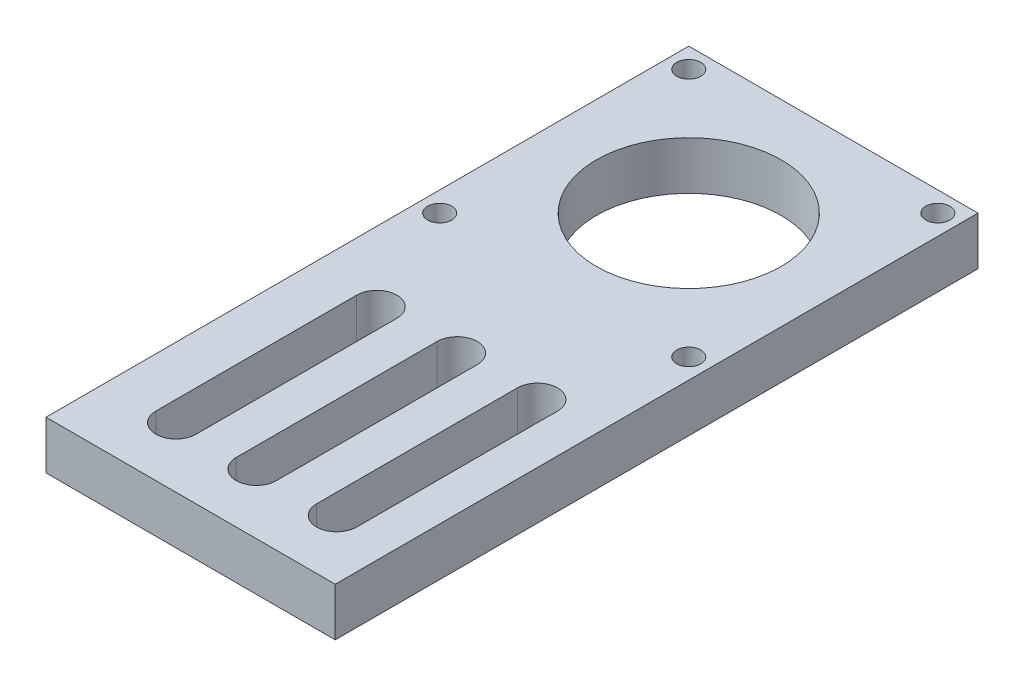
ISO-10303-21;
HEADER;
FILE_DESCRIPTION(('STEP AP214'),'2;1');
FILE_NAME('part.step','',(''),(''),'','','');
FILE_SCHEMA(('AUTOMOTIVE_DESIGN { 1 0 10303 214 1 1 1 1 }'));
ENDSEC;
DATA;
#1=APPLICATION_CONTEXT('core data for automotive mechanical design processes');
#2=APPLICATION_PROTOCOL_DEFINITION('international standard','automotive_design',2000,#1);
#3=PRODUCT_CONTEXT('',#1,'mechanical');
#4=PRODUCT('Part','Part','',(#3));
#5=PRODUCT_RELATED_PRODUCT_CATEGORY('part','',(#4));
#6=PRODUCT_DEFINITION_FORMATION('','',#4);
#7=PRODUCT_DEFINITION_CONTEXT('part definition',#1,'design');
#8=PRODUCT_DEFINITION('design','',#6,#7);
#9=PRODUCT_DEFINITION_SHAPE('','',#8);
#10=(LENGTH_UNIT() NAMED_UNIT(*) SI_UNIT(.MILLI.,.METRE.));
#11=(NAMED_UNIT(*) PLANE_ANGLE_UNIT() SI_UNIT($,.RADIAN.));
#12=(NAMED_UNIT(*) SI_UNIT($,.STERADIAN.) SOLID_ANGLE_UNIT());
#13=UNCERTAINTY_MEASURE_WITH_UNIT(LENGTH_MEASURE(1.E-05),#10,'distance_accuracy_value','');
#14=(GEOMETRIC_REPRESENTATION_CONTEXT(3) GLOBAL_UNCERTAINTY_ASSIGNED_CONTEXT((#13)) GLOBAL_UNIT_ASSIGNED_CONTEXT((#10,
#11,#12)) REPRESENTATION_CONTEXT('',''));
#15=CARTESIAN_POINT('',(0.,0.,0.));
#16=DIRECTION('',(0.,0.,1.));
#17=DIRECTION('',(1.,0.,0.));
#18=AXIS2_PLACEMENT_3D('',#15,#16,#17);
#19=CARTESIAN_POINT('',(0.,6.,0.));
#20=DIRECTION('',(0.,-1.,0.));
#21=DIRECTION('',(0.,0.,-1.));
#22=AXIS2_PLACEMENT_3D('',#19,#20,#21);
#23=PLANE('',#22);
#24=CARTESIAN_POINT('',(10.6727513266154,6.,7.5));
#25=DIRECTION('',(0.,1.,0.));
#26=DIRECTION('',(0.,0.,-1.));
#27=AXIS2_PLACEMENT_3D('',#24,#25,#26);
#28=CIRCLE('',#27,2.5);
#29=CARTESIAN_POINT('',(13.1727513266154,6.,7.5));
#30=VERTEX_POINT('',#29);
#31=CARTESIAN_POINT('',(8.17275132661536,6.,7.5));
#32=VERTEX_POINT('',#31);
#33=EDGE_CURVE('E181',#30,#32,#28,.T.);
#34=ORIENTED_EDGE('',*,*,#33,.F.);
#35=DIRECTION('',(0.,0.,-1.));
#36=VECTOR('',#35,1.);
#37=CARTESIAN_POINT('',(13.1727513266154,6.,32.5));
#38=LINE('',#37,#36);
#39=CARTESIAN_POINT('',(13.1727513266154,6.,32.5));
#40=VERTEX_POINT('',#39);
#41=EDGE_CURVE('E189',#40,#30,#38,.T.);
#42=ORIENTED_EDGE('',*,*,#41,.F.);
#43=CARTESIAN_POINT('',(10.6727513266154,6.,32.5));
#44=DIRECTION('',(0.,1.,0.));
#45=DIRECTION('',(0.,0.,1.));
#46=AXIS2_PLACEMENT_3D('',#43,#44,#45);
#47=CIRCLE('',#46,2.5);
#48=CARTESIAN_POINT('',(8.17275132661536,6.,32.5));
#49=VERTEX_POINT('',#48);
#50=EDGE_CURVE('E186',#49,#40,#47,.T.);
#51=ORIENTED_EDGE('',*,*,#50,.F.);
#52=DIRECTION('',(0.,0.,1.));
#53=VECTOR('',#52,1.);
#54=CARTESIAN_POINT('',(8.17275132661536,6.,32.5));
#55=LINE('',#54,#53);
#56=EDGE_CURVE('E183',#32,#49,#55,.T.);
#57=ORIENTED_EDGE('',*,*,#56,.F.);
#58=EDGE_LOOP('',(#34,#42,#51,#57));
#59=FACE_BOUND('',#58,.T.);
#60=CARTESIAN_POINT('',(-15.5,6.,-6.5));
#61=DIRECTION('',(0.,1.,0.));
#62=DIRECTION('',(0.,0.,1.));
#63=AXIS2_PLACEMENT_3D('',#60,#61,#62);
#64=CIRCLE('',#63,1.5);
#65=CARTESIAN_POINT('',(-15.5,6.,-5.));
#66=VERTEX_POINT('',#65);
#67=EDGE_CURVE('E243',#66,#66,#64,.T.);
#68=ORIENTED_EDGE('',*,*,#67,.F.);
#69=EDGE_LOOP('',(#68));
#70=FACE_BOUND('',#69,.T.);
#71=CARTESIAN_POINT('',(15.5,6.,-6.5));
#72=DIRECTION('',(0.,1.,0.));
#73=DIRECTION('',(0.,0.,1.));
#74=AXIS2_PLACEMENT_3D('',#71,#72,#73);
#75=CIRCLE('',#74,1.5);
#76=CARTESIAN_POINT('',(15.5,6.,-5.00000000000001));
#77=VERTEX_POINT('',#76);
#78=EDGE_CURVE('E249',#77,#77,#75,.T.);
#79=ORIENTED_EDGE('',*,*,#78,.F.);
#80=EDGE_LOOP('',(#79));
#81=FACE_BOUND('',#80,.T.);
#82=CARTESIAN_POINT('',(15.5,6.,-37.5));
#83=DIRECTION('',(0.,1.,0.));
#84=DIRECTION('',(0.,0.,1.));
#85=AXIS2_PLACEMENT_3D('',#82,#83,#84);
#86=CIRCLE('',#85,1.5);
#87=CARTESIAN_POINT('',(15.5,6.,-36.));
#88=VERTEX_POINT('',#87);
#89=EDGE_CURVE('E255',#88,#88,#86,.T.);
#90=ORIENTED_EDGE('',*,*,#89,.F.);
#91=EDGE_LOOP('',(#90));
#92=FACE_BOUND('',#91,.T.);
#93=CARTESIAN_POINT('',(-15.5,6.,-37.5));
#94=DIRECTION('',(0.,1.,0.));
#95=DIRECTION('',(0.,0.,1.));
#96=AXIS2_PLACEMENT_3D('',#93,#94,#95);
#97=CIRCLE('',#96,1.5);
#98=CARTESIAN_POINT('',(-15.5,6.,-36.));
#99=VERTEX_POINT('',#98);
#100=EDGE_CURVE('E261',#99,#99,#97,.T.);
#101=ORIENTED_EDGE('',*,*,#100,.F.);
#102=EDGE_LOOP('',(#101));
#103=FACE_BOUND('',#102,.T.);
#104=CARTESIAN_POINT('',(0.,6.,-22.));
#105=DIRECTION('',(0.,1.,0.));
#106=DIRECTION('',(0.,0.,1.));
#107=AXIS2_PLACEMENT_3D('',#104,#105,#106);
#108=CIRCLE('',#107,11.5);
#109=CARTESIAN_POINT('',(0.,6.,-10.5));
#110=VERTEX_POINT('',#109);
#111=EDGE_CURVE('E267',#110,#110,#108,.T.);
#112=ORIENTED_EDGE('',*,*,#111,.F.);
#113=EDGE_LOOP('',(#112));
#114=FACE_BOUND('',#113,.T.);
#115=DIRECTION('',(0.,0.,-1.));
#116=VECTOR('',#115,1.);
#117=CARTESIAN_POINT('',(18.,6.,40.));
#118=LINE('',#117,#116);
#119=CARTESIAN_POINT('',(18.,6.,40.));
#120=VERTEX_POINT('',#119);
#121=CARTESIAN_POINT('',(18.,6.,-40.));
#122=VERTEX_POINT('',#121);
#123=EDGE_CURVE('E273',#120,#122,#118,.T.);
#124=ORIENTED_EDGE('',*,*,#123,.T.);
#125=DIRECTION('',(-1.,0.,0.));
#126=VECTOR('',#125,1.);
#127=CARTESIAN_POINT('',(-18.,6.,-40.));
#128=LINE('',#127,#126);
#129=CARTESIAN_POINT('',(-18.,6.,-40.));
#130=VERTEX_POINT('',#129);
#131=EDGE_CURVE('E276',#122,#130,#128,.T.);
#132=ORIENTED_EDGE('',*,*,#131,.T.);
#133=DIRECTION('',(0.,0.,1.));
#134=VECTOR('',#133,1.);
#135=CARTESIAN_POINT('',(-18.,6.,40.));
#136=LINE('',#135,#134);
#137=CARTESIAN_POINT('',(-18.,6.,40.));
#138=VERTEX_POINT('',#137);
#139=EDGE_CURVE('E279',#130,#138,#136,.T.);
#140=ORIENTED_EDGE('',*,*,#139,.T.);
#141=DIRECTION('',(1.,0.,0.));
#142=VECTOR('',#141,1.);
#143=CARTESIAN_POINT('',(-18.,6.,40.));
#144=LINE('',#143,#142);
#145=EDGE_CURVE('E281',#138,#120,#144,.T.);
#146=ORIENTED_EDGE('',*,*,#145,.T.);
#147=EDGE_LOOP('',(#124,#132,#140,#146));
#148=FACE_BOUND('',#147,.T.);
#149=CARTESIAN_POINT('',(0.672751326615361,6.,7.5));
#150=DIRECTION('',(0.,1.,0.));
#151=DIRECTION('',(0.,0.,-1.));
#152=AXIS2_PLACEMENT_3D('',#149,#150,#151);
#153=CIRCLE('',#152,2.5);
#154=CARTESIAN_POINT('',(3.17275132661536,6.,7.5));
#155=VERTEX_POINT('',#154);
#156=CARTESIAN_POINT('',(-1.82724867338464,6.,7.5));
#157=VERTEX_POINT('',#156);
#158=EDGE_CURVE('E212',#155,#157,#153,.T.);
#159=ORIENTED_EDGE('',*,*,#158,.F.);
#160=DIRECTION('',(0.,0.,-1.));
#161=VECTOR('',#160,1.);
#162=CARTESIAN_POINT('',(3.17275132661536,6.,32.5));
#163=LINE('',#162,#161);
#164=CARTESIAN_POINT('',(3.17275132661536,6.,32.5));
#165=VERTEX_POINT('',#164);
#166=EDGE_CURVE('E220',#165,#155,#163,.T.);
#167=ORIENTED_EDGE('',*,*,#166,.F.);
#168=CARTESIAN_POINT('',(0.672751326615361,6.,32.5));
#169=DIRECTION('',(0.,1.,0.));
#170=DIRECTION('',(0.,0.,1.));
#171=AXIS2_PLACEMENT_3D('',#168,#169,#170);
#172=CIRCLE('',#171,2.5);
#173=CARTESIAN_POINT('',(-1.82724867338464,6.,32.5));
#174=VERTEX_POINT('',#173);
#175=EDGE_CURVE('E217',#174,#165,#172,.T.);
#176=ORIENTED_EDGE('',*,*,#175,.F.);
#177=DIRECTION('',(0.,0.,1.));
#178=VECTOR('',#177,1.);
#179=CARTESIAN_POINT('',(-1.82724867338464,6.,32.5));
#180=LINE('',#179,#178);
#181=EDGE_CURVE('E214',#157,#174,#180,.T.);
#182=ORIENTED_EDGE('',*,*,#181,.F.);
#183=EDGE_LOOP('',(#159,#167,#176,#182));
#184=FACE_BOUND('',#183,.T.);
#185=CARTESIAN_POINT('',(-9.32724867338463,6.,7.5));
#186=DIRECTION('',(0.,1.,0.));
#187=DIRECTION('',(0.,0.,-1.));
#188=AXIS2_PLACEMENT_3D('',#185,#186,#187);
#189=CIRCLE('',#188,2.5);
#190=CARTESIAN_POINT('',(-6.82724867338463,6.,7.5));
#191=VERTEX_POINT('',#190);
#192=CARTESIAN_POINT('',(-11.8272486733846,6.,7.5));
#193=VERTEX_POINT('',#192);
#194=EDGE_CURVE('E145',#191,#193,#189,.T.);
#195=ORIENTED_EDGE('',*,*,#194,.F.);
#196=DIRECTION('',(0.,0.,-1.));
#197=VECTOR('',#196,1.);
#198=CARTESIAN_POINT('',(-6.82724867338463,6.,32.5));
#199=LINE('',#198,#197);
#200=CARTESIAN_POINT('',(-6.82724867338463,6.,32.5));
#201=VERTEX_POINT('',#200);
#202=EDGE_CURVE('E167',#201,#191,#199,.T.);
#203=ORIENTED_EDGE('',*,*,#202,.F.);
#204=CARTESIAN_POINT('',(-9.32724867338463,6.,32.5));
#205=DIRECTION('',(0.,1.,0.));
#206=DIRECTION('',(0.,0.,-1.));
#207=AXIS2_PLACEMENT_3D('',#204,#205,#206);
#208=CIRCLE('',#207,2.5);
#209=CARTESIAN_POINT('',(-11.8272486733846,6.,32.5));
#210=VERTEX_POINT('',#209);
#211=EDGE_CURVE('E165',#210,#201,#208,.T.);
#212=ORIENTED_EDGE('',*,*,#211,.F.);
#213=DIRECTION('',(0.,0.,1.));
#214=VECTOR('',#213,1.);
#215=CARTESIAN_POINT('',(-11.8272486733846,6.,32.5));
#216=LINE('',#215,#214);
#217=EDGE_CURVE('E153',#193,#210,#216,.T.);
#218=ORIENTED_EDGE('',*,*,#217,.F.);
#219=EDGE_LOOP('',(#195,#203,#212,#218));
#220=FACE_BOUND('',#219,.T.);
#221=ADVANCED_FACE('F32',(#59,#70,#81,#92,#103,#114,#148,#184,#220),#23,.F.);
#222=CARTESIAN_POINT('',(0.,0.,0.));
#223=DIRECTION('',(0.,-1.,0.));
#224=DIRECTION('',(0.,0.,-1.));
#225=AXIS2_PLACEMENT_3D('',#222,#223,#224);
#226=PLANE('',#225);
#227=CARTESIAN_POINT('',(15.5,0.,-6.5));
#228=DIRECTION('',(0.,1.,0.));
#229=DIRECTION('',(0.,0.,1.));
#230=AXIS2_PLACEMENT_3D('',#227,#228,#229);
#231=CIRCLE('',#230,1.5);
#232=CARTESIAN_POINT('',(15.5,0.,-5.00000000000001));
#233=VERTEX_POINT('',#232);
#234=EDGE_CURVE('E246',#233,#233,#231,.T.);
#235=ORIENTED_EDGE('',*,*,#234,.T.);
#236=EDGE_LOOP('',(#235));
#237=FACE_BOUND('',#236,.T.);
#238=CARTESIAN_POINT('',(-15.5,0.,-37.5));
#239=DIRECTION('',(0.,1.,0.));
#240=DIRECTION('',(0.,0.,1.));
#241=AXIS2_PLACEMENT_3D('',#238,#239,#240);
#242=CIRCLE('',#241,1.5);
#243=CARTESIAN_POINT('',(-15.5,0.,-36.));
#244=VERTEX_POINT('',#243);
#245=EDGE_CURVE('E258',#244,#244,#242,.T.);
#246=ORIENTED_EDGE('',*,*,#245,.T.);
#247=EDGE_LOOP('',(#246));
#248=FACE_BOUND('',#247,.T.);
#249=DIRECTION('',(0.,0.,-1.));
#250=VECTOR('',#249,1.);
#251=CARTESIAN_POINT('',(18.,0.,40.));
#252=LINE('',#251,#250);
#253=CARTESIAN_POINT('',(18.,0.,40.));
#254=VERTEX_POINT('',#253);
#255=CARTESIAN_POINT('',(18.,0.,-40.));
#256=VERTEX_POINT('',#255);
#257=EDGE_CURVE('E270',#254,#256,#252,.T.);
#258=ORIENTED_EDGE('',*,*,#257,.F.);
#259=DIRECTION('',(1.,0.,0.));
#260=VECTOR('',#259,1.);
#261=CARTESIAN_POINT('',(-18.,0.,40.));
#262=LINE('',#261,#260);
#263=CARTESIAN_POINT('',(-18.,0.,40.));
#264=VERTEX_POINT('',#263);
#265=EDGE_CURVE('E277',#264,#254,#262,.T.);
#266=ORIENTED_EDGE('',*,*,#265,.F.);
#267=DIRECTION('',(0.,0.,1.));
#268=VECTOR('',#267,1.);
#269=CARTESIAN_POINT('',(-18.,0.,40.));
#270=LINE('',#269,#268);
#271=CARTESIAN_POINT('',(-18.,0.,-40.));
#272=VERTEX_POINT('',#271);
#273=EDGE_CURVE('E288',#272,#264,#270,.T.);
#274=ORIENTED_EDGE('',*,*,#273,.F.);
#275=DIRECTION('',(-1.,0.,0.));
#276=VECTOR('',#275,1.);
#277=CARTESIAN_POINT('',(-18.,0.,-40.));
#278=LINE('',#277,#276);
#279=EDGE_CURVE('E286',#256,#272,#278,.T.);
#280=ORIENTED_EDGE('',*,*,#279,.F.);
#281=EDGE_LOOP('',(#258,#266,#274,#280));
#282=FACE_BOUND('',#281,.T.);
#283=CARTESIAN_POINT('',(0.,0.,-22.));
#284=DIRECTION('',(0.,1.,0.));
#285=DIRECTION('',(0.,0.,1.));
#286=AXIS2_PLACEMENT_3D('',#283,#284,#285);
#287=CIRCLE('',#286,11.5);
#288=CARTESIAN_POINT('',(0.,0.,-10.5));
#289=VERTEX_POINT('',#288);
#290=EDGE_CURVE('E264',#289,#289,#287,.T.);
#291=ORIENTED_EDGE('',*,*,#290,.T.);
#292=EDGE_LOOP('',(#291));
#293=FACE_BOUND('',#292,.T.);
#294=CARTESIAN_POINT('',(15.5,0.,-37.5));
#295=DIRECTION('',(0.,1.,0.));
#296=DIRECTION('',(0.,0.,1.));
#297=AXIS2_PLACEMENT_3D('',#294,#295,#296);
#298=CIRCLE('',#297,1.5);
#299=CARTESIAN_POINT('',(15.5,0.,-36.));
#300=VERTEX_POINT('',#299);
#301=EDGE_CURVE('E252',#300,#300,#298,.T.);
#302=ORIENTED_EDGE('',*,*,#301,.T.);
#303=EDGE_LOOP('',(#302));
#304=FACE_BOUND('',#303,.T.);
#305=CARTESIAN_POINT('',(-15.5,0.,-6.5));
#306=DIRECTION('',(0.,1.,0.));
#307=DIRECTION('',(0.,0.,1.));
#308=AXIS2_PLACEMENT_3D('',#305,#306,#307);
#309=CIRCLE('',#308,1.5);
#310=CARTESIAN_POINT('',(-15.5,0.,-5.));
#311=VERTEX_POINT('',#310);
#312=EDGE_CURVE('E242',#311,#311,#309,.T.);
#313=ORIENTED_EDGE('',*,*,#312,.T.);
#314=EDGE_LOOP('',(#313));
#315=FACE_BOUND('',#314,.T.);
#316=DIRECTION('',(0.,0.,-1.));
#317=VECTOR('',#316,1.);
#318=CARTESIAN_POINT('',(3.17275132661536,0.,32.5));
#319=LINE('',#318,#317);
#320=CARTESIAN_POINT('',(3.17275132661536,0.,32.5));
#321=VERTEX_POINT('',#320);
#322=CARTESIAN_POINT('',(3.17275132661536,0.,7.5));
#323=VERTEX_POINT('',#322);
#324=EDGE_CURVE('E215',#321,#323,#319,.T.);
#325=ORIENTED_EDGE('',*,*,#324,.T.);
#326=CARTESIAN_POINT('',(0.672751326615361,0.,7.5));
#327=DIRECTION('',(0.,1.,0.));
#328=DIRECTION('',(0.,0.,-1.));
#329=AXIS2_PLACEMENT_3D('',#326,#327,#328);
#330=CIRCLE('',#329,2.5);
#331=CARTESIAN_POINT('',(-1.82724867338464,0.,7.5));
#332=VERTEX_POINT('',#331);
#333=EDGE_CURVE('E211',#323,#332,#330,.T.);
#334=ORIENTED_EDGE('',*,*,#333,.T.);
#335=DIRECTION('',(0.,0.,1.));
#336=VECTOR('',#335,1.);
#337=CARTESIAN_POINT('',(-1.82724867338464,0.,32.5));
#338=LINE('',#337,#336);
#339=CARTESIAN_POINT('',(-1.82724867338464,0.,32.5));
#340=VERTEX_POINT('',#339);
#341=EDGE_CURVE('E225',#332,#340,#338,.T.);
#342=ORIENTED_EDGE('',*,*,#341,.T.);
#343=CARTESIAN_POINT('',(0.672751326615361,0.,32.5));
#344=DIRECTION('',(0.,1.,0.));
#345=DIRECTION('',(0.,0.,1.));
#346=AXIS2_PLACEMENT_3D('',#343,#344,#345);
#347=CIRCLE('',#346,2.5);
#348=EDGE_CURVE('E228',#340,#321,#347,.T.);
#349=ORIENTED_EDGE('',*,*,#348,.T.);
#350=EDGE_LOOP('',(#325,#334,#342,#349));
#351=FACE_BOUND('',#350,.T.);
#352=DIRECTION('',(0.,0.,-1.));
#353=VECTOR('',#352,1.);
#354=CARTESIAN_POINT('',(13.1727513266154,0.,32.5));
#355=LINE('',#354,#353);
#356=CARTESIAN_POINT('',(13.1727513266154,0.,32.5));
#357=VERTEX_POINT('',#356);
#358=CARTESIAN_POINT('',(13.1727513266154,0.,7.5));
#359=VERTEX_POINT('',#358);
#360=EDGE_CURVE('E184',#357,#359,#355,.T.);
#361=ORIENTED_EDGE('',*,*,#360,.T.);
#362=CARTESIAN_POINT('',(10.6727513266154,0.,7.5));
#363=DIRECTION('',(0.,1.,0.));
#364=DIRECTION('',(0.,0.,-1.));
#365=AXIS2_PLACEMENT_3D('',#362,#363,#364);
#366=CIRCLE('',#365,2.5);
#367=CARTESIAN_POINT('',(8.17275132661536,0.,7.5));
#368=VERTEX_POINT('',#367);
#369=EDGE_CURVE('E161',#359,#368,#366,.T.);
#370=ORIENTED_EDGE('',*,*,#369,.T.);
#371=DIRECTION('',(0.,0.,1.));
#372=VECTOR('',#371,1.);
#373=CARTESIAN_POINT('',(8.17275132661536,0.,32.5));
#374=LINE('',#373,#372);
#375=CARTESIAN_POINT('',(8.17275132661536,0.,32.5));
#376=VERTEX_POINT('',#375);
#377=EDGE_CURVE('E194',#368,#376,#374,.T.);
#378=ORIENTED_EDGE('',*,*,#377,.T.);
#379=CARTESIAN_POINT('',(10.6727513266154,0.,32.5));
#380=DIRECTION('',(0.,1.,0.));
#381=DIRECTION('',(0.,0.,1.));
#382=AXIS2_PLACEMENT_3D('',#379,#380,#381);
#383=CIRCLE('',#382,2.5);
#384=EDGE_CURVE('E197',#376,#357,#383,.T.);
#385=ORIENTED_EDGE('',*,*,#384,.T.);
#386=EDGE_LOOP('',(#361,#370,#378,#385));
#387=FACE_BOUND('',#386,.T.);
#388=DIRECTION('',(0.,0.,-1.));
#389=VECTOR('',#388,1.);
#390=CARTESIAN_POINT('',(-6.82724867338463,0.,32.5));
#391=LINE('',#390,#389);
#392=CARTESIAN_POINT('',(-6.82724867338463,0.,32.5));
#393=VERTEX_POINT('',#392);
#394=CARTESIAN_POINT('',(-6.82724867338463,0.,7.5));
#395=VERTEX_POINT('',#394);
#396=EDGE_CURVE('E154',#393,#395,#391,.T.);
#397=ORIENTED_EDGE('',*,*,#396,.T.);
#398=CARTESIAN_POINT('',(-9.32724867338463,0.,7.5));
#399=DIRECTION('',(0.,1.,0.));
#400=DIRECTION('',(0.,0.,-1.));
#401=AXIS2_PLACEMENT_3D('',#398,#399,#400);
#402=CIRCLE('',#401,2.5);
#403=CARTESIAN_POINT('',(-11.8272486733846,0.,7.5));
#404=VERTEX_POINT('',#403);
#405=EDGE_CURVE('E55',#395,#404,#402,.T.);
#406=ORIENTED_EDGE('',*,*,#405,.T.);
#407=DIRECTION('',(0.,0.,1.));
#408=VECTOR('',#407,1.);
#409=CARTESIAN_POINT('',(-11.8272486733846,0.,32.5));
#410=LINE('',#409,#408);
#411=CARTESIAN_POINT('',(-11.8272486733846,0.,32.5));
#412=VERTEX_POINT('',#411);
#413=EDGE_CURVE('E160',#404,#412,#410,.T.);
#414=ORIENTED_EDGE('',*,*,#413,.T.);
#415=CARTESIAN_POINT('',(-9.32724867338463,0.,32.5));
#416=DIRECTION('',(0.,1.,0.));
#417=DIRECTION('',(0.,0.,-1.));
#418=AXIS2_PLACEMENT_3D('',#415,#416,#417);
#419=CIRCLE('',#418,2.5);
#420=EDGE_CURVE('E173',#412,#393,#419,.T.);
#421=ORIENTED_EDGE('',*,*,#420,.T.);
#422=EDGE_LOOP('',(#397,#406,#414,#421));
#423=FACE_BOUND('',#422,.T.);
#424=ADVANCED_FACE('F306',(#237,#248,#282,#293,#304,#315,#351,#387,#423),#226,.T.);
#425=CARTESIAN_POINT('',(18.,6.,40.));
#426=DIRECTION('',(-1.,0.,0.));
#427=DIRECTION('',(0.,0.,1.));
#428=AXIS2_PLACEMENT_3D('',#425,#426,#427);
#429=PLANE('',#428);
#430=ORIENTED_EDGE('',*,*,#257,.T.);
#431=DIRECTION('',(0.,-1.,0.));
#432=VECTOR('',#431,1.);
#433=CARTESIAN_POINT('',(18.,6.,-40.));
#434=LINE('',#433,#432);
#435=EDGE_CURVE('E11',#122,#256,#434,.T.);
#436=ORIENTED_EDGE('',*,*,#435,.F.);
#437=ORIENTED_EDGE('',*,*,#123,.F.);
#438=DIRECTION('',(0.,-1.,0.));
#439=VECTOR('',#438,1.);
#440=CARTESIAN_POINT('',(18.,6.,40.));
#441=LINE('',#440,#439);
#442=EDGE_CURVE('E283',#120,#254,#441,.T.);
#443=ORIENTED_EDGE('',*,*,#442,.T.);
#444=EDGE_LOOP('',(#430,#436,#437,#443));
#445=FACE_BOUND('',#444,.T.);
#446=ADVANCED_FACE('F34',(#445),#429,.F.);
#447=CARTESIAN_POINT('',(-18.,6.,-40.));
#448=DIRECTION('',(0.,0.,1.));
#449=DIRECTION('',(1.,0.,0.));
#450=AXIS2_PLACEMENT_3D('',#447,#448,#449);
#451=PLANE('',#450);
#452=ORIENTED_EDGE('',*,*,#279,.T.);
#453=DIRECTION('',(0.,-1.,0.));
#454=VECTOR('',#453,1.);
#455=CARTESIAN_POINT('',(-18.,6.,-40.));
#456=LINE('',#455,#454);
#457=EDGE_CURVE('E40',#130,#272,#456,.T.);
#458=ORIENTED_EDGE('',*,*,#457,.F.);
#459=ORIENTED_EDGE('',*,*,#131,.F.);
#460=ORIENTED_EDGE('',*,*,#435,.T.);
#461=EDGE_LOOP('',(#452,#458,#459,#460));
#462=FACE_BOUND('',#461,.T.);
#463=ADVANCED_FACE('F317',(#462),#451,.F.);
#464=CARTESIAN_POINT('',(-18.,6.,40.));
#465=DIRECTION('',(1.,0.,0.));
#466=DIRECTION('',(0.,0.,-1.));
#467=AXIS2_PLACEMENT_3D('',#464,#465,#466);
#468=PLANE('',#467);
#469=ORIENTED_EDGE('',*,*,#273,.T.);
#470=DIRECTION('',(0.,-1.,0.));
#471=VECTOR('',#470,1.);
#472=CARTESIAN_POINT('',(-18.,6.,40.));
#473=LINE('',#472,#471);
#474=EDGE_CURVE('E293',#138,#264,#473,.T.);
#475=ORIENTED_EDGE('',*,*,#474,.F.);
#476=ORIENTED_EDGE('',*,*,#139,.F.);
#477=ORIENTED_EDGE('',*,*,#457,.T.);
#478=EDGE_LOOP('',(#469,#475,#476,#477));
#479=FACE_BOUND('',#478,.T.);
#480=ADVANCED_FACE('F300',(#479),#468,.F.);
#481=CARTESIAN_POINT('',(-18.,6.,40.));
#482=DIRECTION('',(0.,0.,-1.));
#483=DIRECTION('',(-1.,0.,0.));
#484=AXIS2_PLACEMENT_3D('',#481,#482,#483);
#485=PLANE('',#484);
#486=ORIENTED_EDGE('',*,*,#265,.T.);
#487=ORIENTED_EDGE('',*,*,#442,.F.);
#488=ORIENTED_EDGE('',*,*,#145,.F.);
#489=ORIENTED_EDGE('',*,*,#474,.T.);
#490=EDGE_LOOP('',(#486,#487,#488,#489));
#491=FACE_BOUND('',#490,.T.);
#492=ADVANCED_FACE('F310',(#491),#485,.F.);
#493=CARTESIAN_POINT('',(0.,6.,-22.));
#494=DIRECTION('',(0.,-1.,0.));
#495=DIRECTION('',(0.,0.,-1.));
#496=AXIS2_PLACEMENT_3D('',#493,#494,#495);
#497=CYLINDRICAL_SURFACE('',#496,11.5);
#498=ORIENTED_EDGE('',*,*,#111,.T.);
#499=EDGE_LOOP('',(#498));
#500=FACE_BOUND('',#499,.T.);
#501=ORIENTED_EDGE('',*,*,#290,.F.);
#502=EDGE_LOOP('',(#501));
#503=FACE_BOUND('',#502,.T.);
#504=ADVANCED_FACE('F335',(#500,#503),#497,.F.);
#505=CARTESIAN_POINT('',(-15.5,6.,-37.5));
#506=DIRECTION('',(0.,-1.,0.));
#507=DIRECTION('',(0.,0.,-1.));
#508=AXIS2_PLACEMENT_3D('',#505,#506,#507);
#509=CYLINDRICAL_SURFACE('',#508,1.5);
#510=ORIENTED_EDGE('',*,*,#100,.T.);
#511=EDGE_LOOP('',(#510));
#512=FACE_BOUND('',#511,.T.);
#513=ORIENTED_EDGE('',*,*,#245,.F.);
#514=EDGE_LOOP('',(#513));
#515=FACE_BOUND('',#514,.T.);
#516=ADVANCED_FACE('F342',(#512,#515),#509,.F.);
#517=CARTESIAN_POINT('',(15.5,6.,-37.5));
#518=DIRECTION('',(0.,-1.,0.));
#519=DIRECTION('',(0.,0.,-1.));
#520=AXIS2_PLACEMENT_3D('',#517,#518,#519);
#521=CYLINDRICAL_SURFACE('',#520,1.5);
#522=ORIENTED_EDGE('',*,*,#89,.T.);
#523=EDGE_LOOP('',(#522));
#524=FACE_BOUND('',#523,.T.);
#525=ORIENTED_EDGE('',*,*,#301,.F.);
#526=EDGE_LOOP('',(#525));
#527=FACE_BOUND('',#526,.T.);
#528=ADVANCED_FACE('F347',(#524,#527),#521,.F.);
#529=CARTESIAN_POINT('',(15.5,6.,-6.5));
#530=DIRECTION('',(0.,-1.,0.));
#531=DIRECTION('',(0.,0.,-1.));
#532=AXIS2_PLACEMENT_3D('',#529,#530,#531);
#533=CYLINDRICAL_SURFACE('',#532,1.5);
#534=ORIENTED_EDGE('',*,*,#78,.T.);
#535=EDGE_LOOP('',(#534));
#536=FACE_BOUND('',#535,.T.);
#537=ORIENTED_EDGE('',*,*,#234,.F.);
#538=EDGE_LOOP('',(#537));
#539=FACE_BOUND('',#538,.T.);
#540=ADVANCED_FACE('F411',(#536,#539),#533,.F.);
#541=CARTESIAN_POINT('',(-15.5,6.,-6.5));
#542=DIRECTION('',(0.,-1.,0.));
#543=DIRECTION('',(0.,0.,-1.));
#544=AXIS2_PLACEMENT_3D('',#541,#542,#543);
#545=CYLINDRICAL_SURFACE('',#544,1.5);
#546=ORIENTED_EDGE('',*,*,#67,.T.);
#547=EDGE_LOOP('',(#546));
#548=FACE_BOUND('',#547,.T.);
#549=ORIENTED_EDGE('',*,*,#312,.F.);
#550=EDGE_LOOP('',(#549));
#551=FACE_BOUND('',#550,.T.);
#552=ADVANCED_FACE('F407',(#548,#551),#545,.F.);
#553=CARTESIAN_POINT('',(0.672751326615361,6.,7.5));
#554=DIRECTION('',(0.,-1.,0.));
#555=DIRECTION('',(0.,0.,-1.));
#556=AXIS2_PLACEMENT_3D('',#553,#554,#555);
#557=CYLINDRICAL_SURFACE('',#556,2.5);
#558=ORIENTED_EDGE('',*,*,#333,.F.);
#559=DIRECTION('',(0.,-1.,0.));
#560=VECTOR('',#559,1.);
#561=CARTESIAN_POINT('',(3.17275132661536,6.,7.5));
#562=LINE('',#561,#560);
#563=EDGE_CURVE('E222',#155,#323,#562,.T.);
#564=ORIENTED_EDGE('',*,*,#563,.F.);
#565=ORIENTED_EDGE('',*,*,#158,.T.);
#566=DIRECTION('',(0.,-1.,0.));
#567=VECTOR('',#566,1.);
#568=CARTESIAN_POINT('',(-1.82724867338464,6.,7.5));
#569=LINE('',#568,#567);
#570=EDGE_CURVE('E239',#157,#332,#569,.T.);
#571=ORIENTED_EDGE('',*,*,#570,.T.);
#572=EDGE_LOOP('',(#558,#564,#565,#571));
#573=FACE_BOUND('',#572,.T.);
#574=ADVANCED_FACE('F403',(#573),#557,.F.);
#575=CARTESIAN_POINT('',(-1.82724867338464,6.,32.5));
#576=DIRECTION('',(1.,0.,0.));
#577=DIRECTION('',(0.,0.,-1.));
#578=AXIS2_PLACEMENT_3D('',#575,#576,#577);
#579=PLANE('',#578);
#580=ORIENTED_EDGE('',*,*,#341,.F.);
#581=ORIENTED_EDGE('',*,*,#570,.F.);
#582=ORIENTED_EDGE('',*,*,#181,.T.);
#583=DIRECTION('',(0.,-1.,0.));
#584=VECTOR('',#583,1.);
#585=CARTESIAN_POINT('',(-1.82724867338464,6.,32.5));
#586=LINE('',#585,#584);
#587=EDGE_CURVE('E237',#174,#340,#586,.T.);
#588=ORIENTED_EDGE('',*,*,#587,.T.);
#589=EDGE_LOOP('',(#580,#581,#582,#588));
#590=FACE_BOUND('',#589,.T.);
#591=ADVANCED_FACE('F399',(#590),#579,.T.);
#592=CARTESIAN_POINT('',(0.672751326615361,6.,32.5));
#593=DIRECTION('',(0.,-1.,0.));
#594=DIRECTION('',(0.,0.,-1.));
#595=AXIS2_PLACEMENT_3D('',#592,#593,#594);
#596=CYLINDRICAL_SURFACE('',#595,2.5);
#597=ORIENTED_EDGE('',*,*,#348,.F.);
#598=ORIENTED_EDGE('',*,*,#587,.F.);
#599=ORIENTED_EDGE('',*,*,#175,.T.);
#600=DIRECTION('',(0.,-1.,0.));
#601=VECTOR('',#600,1.);
#602=CARTESIAN_POINT('',(3.17275132661536,6.,32.5));
#603=LINE('',#602,#601);
#604=EDGE_CURVE('E235',#165,#321,#603,.T.);
#605=ORIENTED_EDGE('',*,*,#604,.T.);
#606=EDGE_LOOP('',(#597,#598,#599,#605));
#607=FACE_BOUND('',#606,.T.);
#608=ADVANCED_FACE('F395',(#607),#596,.F.);
#609=CARTESIAN_POINT('',(3.17275132661536,6.,32.5));
#610=DIRECTION('',(-1.,0.,0.));
#611=DIRECTION('',(0.,0.,1.));
#612=AXIS2_PLACEMENT_3D('',#609,#610,#611);
#613=PLANE('',#612);
#614=ORIENTED_EDGE('',*,*,#324,.F.);
#615=ORIENTED_EDGE('',*,*,#604,.F.);
#616=ORIENTED_EDGE('',*,*,#166,.T.);
#617=ORIENTED_EDGE('',*,*,#563,.T.);
#618=EDGE_LOOP('',(#614,#615,#616,#617));
#619=FACE_BOUND('',#618,.T.);
#620=ADVANCED_FACE('F391',(#619),#613,.T.);
#621=CARTESIAN_POINT('',(10.6727513266154,6.,7.5));
#622=DIRECTION('',(0.,-1.,0.));
#623=DIRECTION('',(0.,0.,-1.));
#624=AXIS2_PLACEMENT_3D('',#621,#622,#623);
#625=CYLINDRICAL_SURFACE('',#624,2.5);
#626=ORIENTED_EDGE('',*,*,#369,.F.);
#627=DIRECTION('',(0.,-1.,0.));
#628=VECTOR('',#627,1.);
#629=CARTESIAN_POINT('',(13.1727513266154,6.,7.5));
#630=LINE('',#629,#628);
#631=EDGE_CURVE('E191',#30,#359,#630,.T.);
#632=ORIENTED_EDGE('',*,*,#631,.F.);
#633=ORIENTED_EDGE('',*,*,#33,.T.);
#634=DIRECTION('',(0.,-1.,0.));
#635=VECTOR('',#634,1.);
#636=CARTESIAN_POINT('',(8.17275132661536,6.,7.5));
#637=LINE('',#636,#635);
#638=EDGE_CURVE('E208',#32,#368,#637,.T.);
#639=ORIENTED_EDGE('',*,*,#638,.T.);
#640=EDGE_LOOP('',(#626,#632,#633,#639));
#641=FACE_BOUND('',#640,.T.);
#642=ADVANCED_FACE('F387',(#641),#625,.F.);
#643=CARTESIAN_POINT('',(8.17275132661536,6.,32.5));
#644=DIRECTION('',(1.,0.,0.));
#645=DIRECTION('',(0.,0.,-1.));
#646=AXIS2_PLACEMENT_3D('',#643,#644,#645);
#647=PLANE('',#646);
#648=ORIENTED_EDGE('',*,*,#377,.F.);
#649=ORIENTED_EDGE('',*,*,#638,.F.);
#650=ORIENTED_EDGE('',*,*,#56,.T.);
#651=DIRECTION('',(0.,-1.,0.));
#652=VECTOR('',#651,1.);
#653=CARTESIAN_POINT('',(8.17275132661536,6.,32.5));
#654=LINE('',#653,#652);
#655=EDGE_CURVE('E206',#49,#376,#654,.T.);
#656=ORIENTED_EDGE('',*,*,#655,.T.);
#657=EDGE_LOOP('',(#648,#649,#650,#656));
#658=FACE_BOUND('',#657,.T.);
#659=ADVANCED_FACE('F383',(#658),#647,.T.);
#660=CARTESIAN_POINT('',(10.6727513266154,6.,32.5));
#661=DIRECTION('',(0.,-1.,0.));
#662=DIRECTION('',(0.,0.,-1.));
#663=AXIS2_PLACEMENT_3D('',#660,#661,#662);
#664=CYLINDRICAL_SURFACE('',#663,2.5);
#665=ORIENTED_EDGE('',*,*,#384,.F.);
#666=ORIENTED_EDGE('',*,*,#655,.F.);
#667=ORIENTED_EDGE('',*,*,#50,.T.);
#668=DIRECTION('',(0.,-1.,0.));
#669=VECTOR('',#668,1.);
#670=CARTESIAN_POINT('',(13.1727513266154,6.,32.5));
#671=LINE('',#670,#669);
#672=EDGE_CURVE('E204',#40,#357,#671,.T.);
#673=ORIENTED_EDGE('',*,*,#672,.T.);
#674=EDGE_LOOP('',(#665,#666,#667,#673));
#675=FACE_BOUND('',#674,.T.);
#676=ADVANCED_FACE('F379',(#675),#664,.F.);
#677=CARTESIAN_POINT('',(13.1727513266154,6.,32.5));
#678=DIRECTION('',(-1.,0.,0.));
#679=DIRECTION('',(0.,0.,1.));
#680=AXIS2_PLACEMENT_3D('',#677,#678,#679);
#681=PLANE('',#680);
#682=ORIENTED_EDGE('',*,*,#360,.F.);
#683=ORIENTED_EDGE('',*,*,#672,.F.);
#684=ORIENTED_EDGE('',*,*,#41,.T.);
#685=ORIENTED_EDGE('',*,*,#631,.T.);
#686=EDGE_LOOP('',(#682,#683,#684,#685));
#687=FACE_BOUND('',#686,.T.);
#688=ADVANCED_FACE('F376',(#687),#681,.T.);
#689=CARTESIAN_POINT('',(-9.32724867338463,6.,7.5));
#690=DIRECTION('',(0.,-1.,0.));
#691=DIRECTION('',(0.,0.,-1.));
#692=AXIS2_PLACEMENT_3D('',#689,#690,#691);
#693=CYLINDRICAL_SURFACE('',#692,2.5);
#694=ORIENTED_EDGE('',*,*,#405,.F.);
#695=DIRECTION('',(0.,-1.,0.));
#696=VECTOR('',#695,1.);
#697=CARTESIAN_POINT('',(-6.82724867338463,6.,7.5));
#698=LINE('',#697,#696);
#699=EDGE_CURVE('E149',#191,#395,#698,.T.);
#700=ORIENTED_EDGE('',*,*,#699,.F.);
#701=ORIENTED_EDGE('',*,*,#194,.T.);
#702=DIRECTION('',(0.,-1.,0.));
#703=VECTOR('',#702,1.);
#704=CARTESIAN_POINT('',(-11.8272486733846,6.,7.5));
#705=LINE('',#704,#703);
#706=EDGE_CURVE('E148',#193,#404,#705,.T.);
#707=ORIENTED_EDGE('',*,*,#706,.T.);
#708=EDGE_LOOP('',(#694,#700,#701,#707));
#709=FACE_BOUND('',#708,.T.);
#710=ADVANCED_FACE('F147',(#709),#693,.F.);
#711=CARTESIAN_POINT('',(-11.8272486733846,6.,32.5));
#712=DIRECTION('',(1.,0.,0.));
#713=DIRECTION('',(0.,0.,-1.));
#714=AXIS2_PLACEMENT_3D('',#711,#712,#713);
#715=PLANE('',#714);
#716=ORIENTED_EDGE('',*,*,#413,.F.);
#717=ORIENTED_EDGE('',*,*,#706,.F.);
#718=ORIENTED_EDGE('',*,*,#217,.T.);
#719=DIRECTION('',(0.,-1.,0.));
#720=VECTOR('',#719,1.);
#721=CARTESIAN_POINT('',(-11.8272486733846,6.,32.5));
#722=LINE('',#721,#720);
#723=EDGE_CURVE('E162',#210,#412,#722,.T.);
#724=ORIENTED_EDGE('',*,*,#723,.T.);
#725=EDGE_LOOP('',(#716,#717,#718,#724));
#726=FACE_BOUND('',#725,.T.);
#727=ADVANCED_FACE('F157',(#726),#715,.T.);
#728=CARTESIAN_POINT('',(-9.32724867338463,6.,32.5));
#729=DIRECTION('',(0.,-1.,0.));
#730=DIRECTION('',(0.,0.,-1.));
#731=AXIS2_PLACEMENT_3D('',#728,#729,#730);
#732=CYLINDRICAL_SURFACE('',#731,2.5);
#733=ORIENTED_EDGE('',*,*,#420,.F.);
#734=ORIENTED_EDGE('',*,*,#723,.F.);
#735=ORIENTED_EDGE('',*,*,#211,.T.);
#736=DIRECTION('',(0.,-1.,0.));
#737=VECTOR('',#736,1.);
#738=CARTESIAN_POINT('',(-6.82724867338463,6.,32.5));
#739=LINE('',#738,#737);
#740=EDGE_CURVE('E47',#201,#393,#739,.T.);
#741=ORIENTED_EDGE('',*,*,#740,.T.);
#742=EDGE_LOOP('',(#733,#734,#735,#741));
#743=FACE_BOUND('',#742,.T.);
#744=ADVANCED_FACE('F364',(#743),#732,.F.);
#745=CARTESIAN_POINT('',(-6.82724867338463,6.,32.5));
#746=DIRECTION('',(-1.,0.,0.));
#747=DIRECTION('',(0.,0.,1.));
#748=AXIS2_PLACEMENT_3D('',#745,#746,#747);
#749=PLANE('',#748);
#750=ORIENTED_EDGE('',*,*,#396,.F.);
#751=ORIENTED_EDGE('',*,*,#740,.F.);
#752=ORIENTED_EDGE('',*,*,#202,.T.);
#753=ORIENTED_EDGE('',*,*,#699,.T.);
#754=EDGE_LOOP('',(#750,#751,#752,#753));
#755=FACE_BOUND('',#754,.T.);
#756=ADVANCED_FACE('F362',(#755),#749,.T.);
#757=CLOSED_SHELL('',(#221,#424,#446,#463,#480,#492,#504,#516,#528,#540,#552,#574,#591,#608,
#620,#642,#659,#676,#688,#710,#727,#744,#756));
#758=MANIFOLD_SOLID_BREP('B2',#757);
#759=ADVANCED_BREP_SHAPE_REPRESENTATION('',(#18,#758),#14);
#760=SHAPE_DEFINITION_REPRESENTATION(#9,#759);
ENDSEC;
END-ISO-10303-21;
